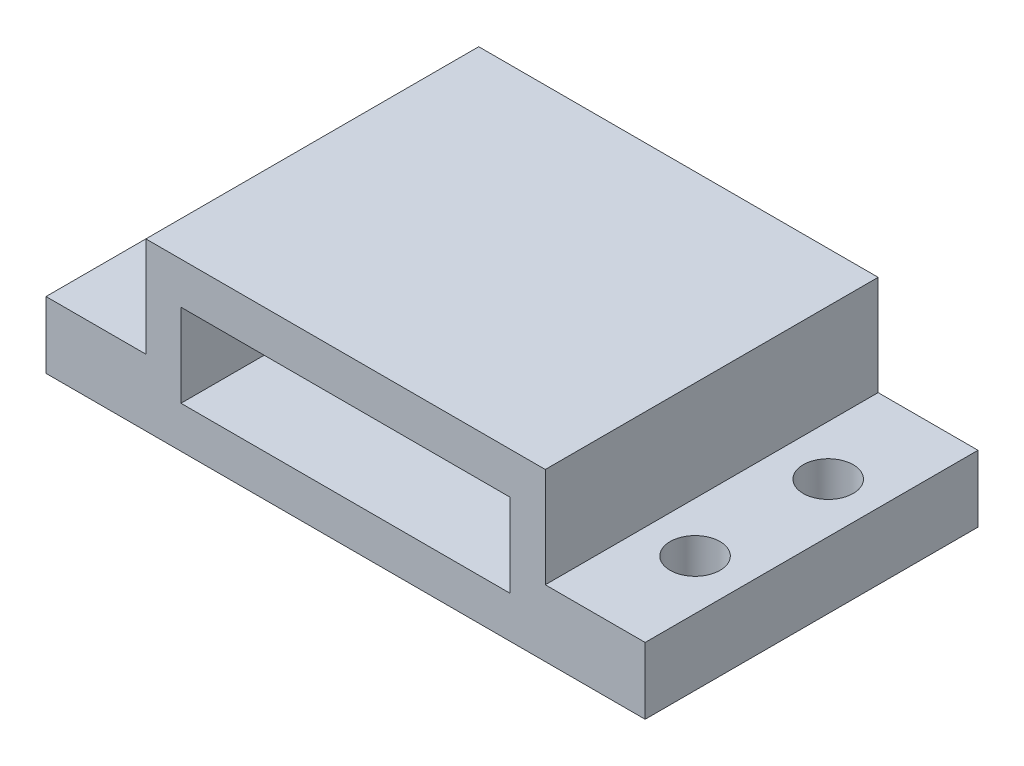
ISO-10303-21;
HEADER;
FILE_DESCRIPTION(('STEP AP214'),'2;1');
FILE_NAME('part.step','',(''),(''),'','','');
FILE_SCHEMA(('AUTOMOTIVE_DESIGN { 1 0 10303 214 1 1 1 1 }'));
ENDSEC;
DATA;
#1=APPLICATION_CONTEXT('core data for automotive mechanical design processes');
#2=APPLICATION_PROTOCOL_DEFINITION('international standard','automotive_design',2000,#1);
#3=PRODUCT_CONTEXT('',#1,'mechanical');
#4=PRODUCT('Part','Part','',(#3));
#5=PRODUCT_RELATED_PRODUCT_CATEGORY('part','',(#4));
#6=PRODUCT_DEFINITION_FORMATION('','',#4);
#7=PRODUCT_DEFINITION_CONTEXT('part definition',#1,'design');
#8=PRODUCT_DEFINITION('design','',#6,#7);
#9=PRODUCT_DEFINITION_SHAPE('','',#8);
#10=(LENGTH_UNIT() NAMED_UNIT(*) SI_UNIT(.MILLI.,.METRE.));
#11=(NAMED_UNIT(*) PLANE_ANGLE_UNIT() SI_UNIT($,.RADIAN.));
#12=(NAMED_UNIT(*) SI_UNIT($,.STERADIAN.) SOLID_ANGLE_UNIT());
#13=UNCERTAINTY_MEASURE_WITH_UNIT(LENGTH_MEASURE(1.E-05),#10,'distance_accuracy_value','');
#14=(GEOMETRIC_REPRESENTATION_CONTEXT(3) GLOBAL_UNCERTAINTY_ASSIGNED_CONTEXT((#13)) GLOBAL_UNIT_ASSIGNED_CONTEXT((#10,
#11,#12)) REPRESENTATION_CONTEXT('',''));
#15=CARTESIAN_POINT('',(0.,0.,0.));
#16=DIRECTION('',(0.,0.,1.));
#17=DIRECTION('',(1.,0.,0.));
#18=AXIS2_PLACEMENT_3D('',#15,#16,#17);
#19=CARTESIAN_POINT('',(6.,5.,0.));
#20=DIRECTION('',(-1.,0.,0.));
#21=DIRECTION('',(0.,0.,1.));
#22=AXIS2_PLACEMENT_3D('',#19,#20,#21);
#23=PLANE('',#22);
#24=DIRECTION('',(0.,0.,1.));
#25=VECTOR('',#24,1.);
#26=CARTESIAN_POINT('',(6.,2.,0.));
#27=LINE('',#26,#25);
#28=CARTESIAN_POINT('',(6.,2.,-10.));
#29=VERTEX_POINT('',#28);
#30=CARTESIAN_POINT('',(6.,2.,0.));
#31=VERTEX_POINT('',#30);
#32=EDGE_CURVE('E61',#29,#31,#27,.T.);
#33=ORIENTED_EDGE('',*,*,#32,.F.);
#34=DIRECTION('',(0.,-1.,0.));
#35=VECTOR('',#34,1.);
#36=CARTESIAN_POINT('',(6.,5.,-10.));
#37=LINE('',#36,#35);
#38=CARTESIAN_POINT('',(6.,5.,-10.));
#39=VERTEX_POINT('',#38);
#40=EDGE_CURVE('E318',#39,#29,#37,.T.);
#41=ORIENTED_EDGE('',*,*,#40,.F.);
#42=DIRECTION('',(0.,0.,-1.));
#43=VECTOR('',#42,1.);
#44=CARTESIAN_POINT('',(6.,5.,0.));
#45=LINE('',#44,#43);
#46=CARTESIAN_POINT('',(6.,5.,0.));
#47=VERTEX_POINT('',#46);
#48=EDGE_CURVE('E307',#47,#39,#45,.T.);
#49=ORIENTED_EDGE('',*,*,#48,.F.);
#50=DIRECTION('',(0.,-1.,0.));
#51=VECTOR('',#50,1.);
#52=CARTESIAN_POINT('',(6.,5.,0.));
#53=LINE('',#52,#51);
#54=EDGE_CURVE('E321',#47,#31,#53,.T.);
#55=ORIENTED_EDGE('',*,*,#54,.T.);
#56=EDGE_LOOP('',(#33,#41,#49,#55));
#57=FACE_BOUND('',#56,.T.);
#58=ADVANCED_FACE('F45',(#57),#23,.F.);
#59=CARTESIAN_POINT('',(0.,5.,-10.));
#60=DIRECTION('',(0.,0.,1.));
#61=DIRECTION('',(1.,0.,0.));
#62=AXIS2_PLACEMENT_3D('',#59,#60,#61);
#63=PLANE('',#62);
#64=DIRECTION('',(-1.,0.,0.));
#65=VECTOR('',#64,1.);
#66=CARTESIAN_POINT('',(0.,0.,-10.));
#67=LINE('',#66,#65);
#68=CARTESIAN_POINT('',(9.,0.,-9.99999999999999));
#69=VERTEX_POINT('',#68);
#70=CARTESIAN_POINT('',(-9.,0.,-10.));
#71=VERTEX_POINT('',#70);
#72=EDGE_CURVE('E160',#69,#71,#67,.T.);
#73=ORIENTED_EDGE('',*,*,#72,.T.);
#74=DIRECTION('',(0.,-1.,0.));
#75=VECTOR('',#74,1.);
#76=CARTESIAN_POINT('',(-9.,0.,-10.));
#77=LINE('',#76,#75);
#78=CARTESIAN_POINT('',(-9.,1.99999368424387,-10.));
#79=VERTEX_POINT('',#78);
#80=EDGE_CURVE('E215',#79,#71,#77,.T.);
#81=ORIENTED_EDGE('',*,*,#80,.F.);
#82=DIRECTION('',(1.,0.,0.));
#83=VECTOR('',#82,1.);
#84=CARTESIAN_POINT('',(-9.,1.99999368424387,-10.));
#85=LINE('',#84,#83);
#86=CARTESIAN_POINT('',(-6.,1.99999368424387,-10.));
#87=VERTEX_POINT('',#86);
#88=EDGE_CURVE('E218',#79,#87,#85,.T.);
#89=ORIENTED_EDGE('',*,*,#88,.T.);
#90=DIRECTION('',(0.,-1.,0.));
#91=VECTOR('',#90,1.);
#92=CARTESIAN_POINT('',(-6.,5.,-10.));
#93=LINE('',#92,#91);
#94=CARTESIAN_POINT('',(-6.,5.,-10.));
#95=VERTEX_POINT('',#94);
#96=EDGE_CURVE('E313',#95,#87,#93,.T.);
#97=ORIENTED_EDGE('',*,*,#96,.F.);
#98=DIRECTION('',(-1.,0.,0.));
#99=VECTOR('',#98,1.);
#100=CARTESIAN_POINT('',(0.,5.,-10.));
#101=LINE('',#100,#99);
#102=EDGE_CURVE('E310',#39,#95,#101,.T.);
#103=ORIENTED_EDGE('',*,*,#102,.F.);
#104=ORIENTED_EDGE('',*,*,#40,.T.);
#105=DIRECTION('',(-1.,0.,0.));
#106=VECTOR('',#105,1.);
#107=CARTESIAN_POINT('',(9.,2.,-10.));
#108=LINE('',#107,#106);
#109=CARTESIAN_POINT('',(9.,2.,-10.));
#110=VERTEX_POINT('',#109);
#111=EDGE_CURVE('E179',#110,#29,#108,.T.);
#112=ORIENTED_EDGE('',*,*,#111,.F.);
#113=DIRECTION('',(0.,1.,0.));
#114=VECTOR('',#113,1.);
#115=CARTESIAN_POINT('',(9.,2.,-10.));
#116=LINE('',#115,#114);
#117=EDGE_CURVE('E175',#69,#110,#116,.T.);
#118=ORIENTED_EDGE('',*,*,#117,.F.);
#119=EDGE_LOOP('',(#73,#81,#89,#97,#103,#104,#112,#118));
#120=FACE_BOUND('',#119,.T.);
#121=DIRECTION('',(0.,1.,0.));
#122=VECTOR('',#121,1.);
#123=CARTESIAN_POINT('',(3.25,0.,-10.));
#124=LINE('',#123,#122);
#125=CARTESIAN_POINT('',(3.25,2.25,-10.));
#126=VERTEX_POINT('',#125);
#127=CARTESIAN_POINT('',(3.25,2.75,-10.));
#128=VERTEX_POINT('',#127);
#129=EDGE_CURVE('E228',#126,#128,#124,.T.);
#130=ORIENTED_EDGE('',*,*,#129,.T.);
#131=DIRECTION('',(1.,0.,0.));
#132=VECTOR('',#131,1.);
#133=CARTESIAN_POINT('',(0.,2.75,-10.));
#134=LINE('',#133,#132);
#135=CARTESIAN_POINT('',(-3.25,2.75,-10.));
#136=VERTEX_POINT('',#135);
#137=EDGE_CURVE('E240',#136,#128,#134,.T.);
#138=ORIENTED_EDGE('',*,*,#137,.F.);
#139=DIRECTION('',(0.,1.,0.));
#140=VECTOR('',#139,1.);
#141=CARTESIAN_POINT('',(-3.25,0.,-10.));
#142=LINE('',#141,#140);
#143=CARTESIAN_POINT('',(-3.25,2.25,-10.));
#144=VERTEX_POINT('',#143);
#145=EDGE_CURVE('E236',#144,#136,#142,.T.);
#146=ORIENTED_EDGE('',*,*,#145,.F.);
#147=DIRECTION('',(-1.,0.,0.));
#148=VECTOR('',#147,1.);
#149=CARTESIAN_POINT('',(0.,2.25,-10.));
#150=LINE('',#149,#148);
#151=EDGE_CURVE('E232',#126,#144,#150,.T.);
#152=ORIENTED_EDGE('',*,*,#151,.F.);
#153=EDGE_LOOP('',(#130,#138,#146,#152));
#154=FACE_BOUND('',#153,.T.);
#155=ADVANCED_FACE('F176',(#120,#154),#63,.F.);
#156=CARTESIAN_POINT('',(0.,0.,-8.));
#157=DIRECTION('',(0.,0.,1.));
#158=DIRECTION('',(1.,0.,0.));
#159=AXIS2_PLACEMENT_3D('',#156,#157,#158);
#160=PLANE('',#159);
#161=DIRECTION('',(0.,1.,0.));
#162=VECTOR('',#161,1.);
#163=CARTESIAN_POINT('',(-4.945,0.,-8.));
#164=LINE('',#163,#162);
#165=CARTESIAN_POINT('',(-4.945,1.25,-8.));
#166=VERTEX_POINT('',#165);
#167=CARTESIAN_POINT('',(-4.945,3.75,-8.));
#168=VERTEX_POINT('',#167);
#169=EDGE_CURVE('E258',#166,#168,#164,.T.);
#170=ORIENTED_EDGE('',*,*,#169,.F.);
#171=DIRECTION('',(1.,0.,0.));
#172=VECTOR('',#171,1.);
#173=CARTESIAN_POINT('',(0.,1.25,-8.));
#174=LINE('',#173,#172);
#175=CARTESIAN_POINT('',(4.945,1.25,-8.));
#176=VERTEX_POINT('',#175);
#177=EDGE_CURVE('E261',#166,#176,#174,.T.);
#178=ORIENTED_EDGE('',*,*,#177,.T.);
#179=DIRECTION('',(0.,1.,0.));
#180=VECTOR('',#179,1.);
#181=CARTESIAN_POINT('',(4.945,0.,-8.));
#182=LINE('',#181,#180);
#183=CARTESIAN_POINT('',(4.945,3.75,-8.));
#184=VERTEX_POINT('',#183);
#185=EDGE_CURVE('E266',#176,#184,#182,.T.);
#186=ORIENTED_EDGE('',*,*,#185,.T.);
#187=DIRECTION('',(-1.,0.,0.));
#188=VECTOR('',#187,1.);
#189=CARTESIAN_POINT('',(0.,3.75,-8.));
#190=LINE('',#189,#188);
#191=EDGE_CURVE('E270',#184,#168,#190,.T.);
#192=ORIENTED_EDGE('',*,*,#191,.T.);
#193=EDGE_LOOP('',(#170,#178,#186,#192));
#194=FACE_BOUND('',#193,.T.);
#195=DIRECTION('',(-1.,0.,0.));
#196=VECTOR('',#195,1.);
#197=CARTESIAN_POINT('',(0.,2.75,-8.));
#198=LINE('',#197,#196);
#199=CARTESIAN_POINT('',(3.25,2.75,-8.));
#200=VERTEX_POINT('',#199);
#201=CARTESIAN_POINT('',(-3.25,2.75,-8.));
#202=VERTEX_POINT('',#201);
#203=EDGE_CURVE('E54',#200,#202,#198,.T.);
#204=ORIENTED_EDGE('',*,*,#203,.F.);
#205=DIRECTION('',(0.,-1.,0.));
#206=VECTOR('',#205,1.);
#207=CARTESIAN_POINT('',(3.25,0.,-8.));
#208=LINE('',#207,#206);
#209=CARTESIAN_POINT('',(3.25,2.25,-8.));
#210=VERTEX_POINT('',#209);
#211=EDGE_CURVE('E11',#200,#210,#208,.T.);
#212=ORIENTED_EDGE('',*,*,#211,.T.);
#213=DIRECTION('',(1.,0.,0.));
#214=VECTOR('',#213,1.);
#215=CARTESIAN_POINT('',(0.,2.25,-8.));
#216=LINE('',#215,#214);
#217=CARTESIAN_POINT('',(-3.25,2.25,-8.));
#218=VERTEX_POINT('',#217);
#219=EDGE_CURVE('E327',#218,#210,#216,.T.);
#220=ORIENTED_EDGE('',*,*,#219,.F.);
#221=DIRECTION('',(0.,-1.,0.));
#222=VECTOR('',#221,1.);
#223=CARTESIAN_POINT('',(-3.25,0.,-8.));
#224=LINE('',#223,#222);
#225=EDGE_CURVE('E330',#202,#218,#224,.T.);
#226=ORIENTED_EDGE('',*,*,#225,.F.);
#227=EDGE_LOOP('',(#204,#212,#220,#226));
#228=FACE_BOUND('',#227,.T.);
#229=ADVANCED_FACE('F346',(#194,#228),#160,.T.);
#230=CARTESIAN_POINT('',(0.,5.,0.));
#231=DIRECTION('',(0.,0.,-1.));
#232=DIRECTION('',(-1.,0.,0.));
#233=AXIS2_PLACEMENT_3D('',#230,#231,#232);
#234=PLANE('',#233);
#235=DIRECTION('',(1.,0.,0.));
#236=VECTOR('',#235,1.);
#237=CARTESIAN_POINT('',(0.,0.,0.));
#238=LINE('',#237,#236);
#239=CARTESIAN_POINT('',(-9.,0.,0.));
#240=VERTEX_POINT('',#239);
#241=CARTESIAN_POINT('',(9.,0.,0.));
#242=VERTEX_POINT('',#241);
#243=EDGE_CURVE('E172',#240,#242,#238,.T.);
#244=ORIENTED_EDGE('',*,*,#243,.T.);
#245=DIRECTION('',(0.,-1.,0.));
#246=VECTOR('',#245,1.);
#247=CARTESIAN_POINT('',(9.,0.,0.));
#248=LINE('',#247,#246);
#249=CARTESIAN_POINT('',(9.,2.,0.));
#250=VERTEX_POINT('',#249);
#251=EDGE_CURVE('E188',#250,#242,#248,.T.);
#252=ORIENTED_EDGE('',*,*,#251,.F.);
#253=DIRECTION('',(-1.,0.,0.));
#254=VECTOR('',#253,1.);
#255=CARTESIAN_POINT('',(9.,2.,0.));
#256=LINE('',#255,#254);
#257=EDGE_CURVE('E200',#250,#31,#256,.T.);
#258=ORIENTED_EDGE('',*,*,#257,.T.);
#259=ORIENTED_EDGE('',*,*,#54,.F.);
#260=DIRECTION('',(1.,0.,0.));
#261=VECTOR('',#260,1.);
#262=CARTESIAN_POINT('',(0.,5.,0.));
#263=LINE('',#262,#261);
#264=CARTESIAN_POINT('',(-6.,5.,0.));
#265=VERTEX_POINT('',#264);
#266=EDGE_CURVE('E304',#265,#47,#263,.T.);
#267=ORIENTED_EDGE('',*,*,#266,.F.);
#268=DIRECTION('',(0.,-1.,0.));
#269=VECTOR('',#268,1.);
#270=CARTESIAN_POINT('',(-6.,5.,0.));
#271=LINE('',#270,#269);
#272=CARTESIAN_POINT('',(-6.,1.99999368424387,0.));
#273=VERTEX_POINT('',#272);
#274=EDGE_CURVE('E324',#265,#273,#271,.T.);
#275=ORIENTED_EDGE('',*,*,#274,.T.);
#276=DIRECTION('',(1.,0.,0.));
#277=VECTOR('',#276,1.);
#278=CARTESIAN_POINT('',(-9.,1.99999368424387,0.));
#279=LINE('',#278,#277);
#280=CARTESIAN_POINT('',(-9.,1.99999368424387,0.));
#281=VERTEX_POINT('',#280);
#282=EDGE_CURVE('E224',#281,#273,#279,.T.);
#283=ORIENTED_EDGE('',*,*,#282,.F.);
#284=DIRECTION('',(0.,1.,0.));
#285=VECTOR('',#284,1.);
#286=CARTESIAN_POINT('',(-9.,1.99999368424387,0.));
#287=LINE('',#286,#285);
#288=EDGE_CURVE('E209',#240,#281,#287,.T.);
#289=ORIENTED_EDGE('',*,*,#288,.F.);
#290=EDGE_LOOP('',(#244,#252,#258,#259,#267,#275,#283,#289));
#291=FACE_BOUND('',#290,.T.);
#292=DIRECTION('',(0.,1.,0.));
#293=VECTOR('',#292,1.);
#294=CARTESIAN_POINT('',(-4.945,0.,0.));
#295=LINE('',#294,#293);
#296=CARTESIAN_POINT('',(-4.945,1.25,0.));
#297=VERTEX_POINT('',#296);
#298=CARTESIAN_POINT('',(-4.945,3.75,0.));
#299=VERTEX_POINT('',#298);
#300=EDGE_CURVE('E248',#297,#299,#295,.T.);
#301=ORIENTED_EDGE('',*,*,#300,.T.);
#302=DIRECTION('',(-1.,0.,0.));
#303=VECTOR('',#302,1.);
#304=CARTESIAN_POINT('',(0.,3.75,0.));
#305=LINE('',#304,#303);
#306=CARTESIAN_POINT('',(4.945,3.75,0.));
#307=VERTEX_POINT('',#306);
#308=EDGE_CURVE('E262',#307,#299,#305,.T.);
#309=ORIENTED_EDGE('',*,*,#308,.F.);
#310=DIRECTION('',(0.,1.,0.));
#311=VECTOR('',#310,1.);
#312=CARTESIAN_POINT('',(4.945,0.,0.));
#313=LINE('',#312,#311);
#314=CARTESIAN_POINT('',(4.945,1.25,0.));
#315=VERTEX_POINT('',#314);
#316=EDGE_CURVE('E282',#315,#307,#313,.T.);
#317=ORIENTED_EDGE('',*,*,#316,.F.);
#318=DIRECTION('',(1.,0.,0.));
#319=VECTOR('',#318,1.);
#320=CARTESIAN_POINT('',(0.,1.25,0.));
#321=LINE('',#320,#319);
#322=EDGE_CURVE('E278',#297,#315,#321,.T.);
#323=ORIENTED_EDGE('',*,*,#322,.F.);
#324=EDGE_LOOP('',(#301,#309,#317,#323));
#325=FACE_BOUND('',#324,.T.);
#326=ADVANCED_FACE('F359',(#291,#325),#234,.F.);
#327=CARTESIAN_POINT('',(-6.,5.,0.));
#328=DIRECTION('',(-1.,0.,0.));
#329=DIRECTION('',(0.,0.,1.));
#330=AXIS2_PLACEMENT_3D('',#327,#328,#329);
#331=PLANE('',#330);
#332=DIRECTION('',(0.,0.,-1.));
#333=VECTOR('',#332,1.);
#334=CARTESIAN_POINT('',(-6.,1.99999368424387,-10.));
#335=LINE('',#334,#333);
#336=EDGE_CURVE('E69',#273,#87,#335,.T.);
#337=ORIENTED_EDGE('',*,*,#336,.F.);
#338=ORIENTED_EDGE('',*,*,#274,.F.);
#339=DIRECTION('',(0.,0.,-1.));
#340=VECTOR('',#339,1.);
#341=CARTESIAN_POINT('',(-6.,5.,0.));
#342=LINE('',#341,#340);
#343=EDGE_CURVE('E171',#265,#95,#342,.T.);
#344=ORIENTED_EDGE('',*,*,#343,.T.);
#345=ORIENTED_EDGE('',*,*,#96,.T.);
#346=EDGE_LOOP('',(#337,#338,#344,#345));
#347=FACE_BOUND('',#346,.T.);
#348=ADVANCED_FACE('F47',(#347),#331,.T.);
#349=CARTESIAN_POINT('',(0.,5.,0.));
#350=DIRECTION('',(0.,1.,0.));
#351=DIRECTION('',(0.,0.,1.));
#352=AXIS2_PLACEMENT_3D('',#349,#350,#351);
#353=PLANE('',#352);
#354=ORIENTED_EDGE('',*,*,#343,.F.);
#355=ORIENTED_EDGE('',*,*,#266,.T.);
#356=ORIENTED_EDGE('',*,*,#48,.T.);
#357=ORIENTED_EDGE('',*,*,#102,.T.);
#358=EDGE_LOOP('',(#354,#355,#356,#357));
#359=FACE_BOUND('',#358,.T.);
#360=ADVANCED_FACE('F370',(#359),#353,.T.);
#361=CARTESIAN_POINT('',(0.,0.,0.));
#362=DIRECTION('',(0.,1.,0.));
#363=DIRECTION('',(0.,0.,1.));
#364=AXIS2_PLACEMENT_3D('',#361,#362,#363);
#365=PLANE('',#364);
#366=CARTESIAN_POINT('',(7.5,0.,-7.));
#367=DIRECTION('',(0.,1.,0.));
#368=DIRECTION('',(0.,0.,1.));
#369=AXIS2_PLACEMENT_3D('',#366,#367,#368);
#370=CIRCLE('',#369,0.749999999999999);
#371=CARTESIAN_POINT('',(7.5,0.,-6.25));
#372=VERTEX_POINT('',#371);
#373=EDGE_CURVE('E668',#372,#372,#370,.T.);
#374=ORIENTED_EDGE('',*,*,#373,.T.);
#375=EDGE_LOOP('',(#374));
#376=FACE_BOUND('',#375,.T.);
#377=CARTESIAN_POINT('',(7.5,0.,-3.));
#378=DIRECTION('',(0.,1.,0.));
#379=DIRECTION('',(0.,0.,1.));
#380=AXIS2_PLACEMENT_3D('',#377,#378,#379);
#381=CIRCLE('',#380,0.749999999999992);
#382=CARTESIAN_POINT('',(7.5,0.,-2.25000000000001));
#383=VERTEX_POINT('',#382);
#384=EDGE_CURVE('E673',#383,#383,#381,.T.);
#385=ORIENTED_EDGE('',*,*,#384,.T.);
#386=EDGE_LOOP('',(#385));
#387=FACE_BOUND('',#386,.T.);
#388=CARTESIAN_POINT('',(-7.5,0.,-3.));
#389=DIRECTION('',(0.,1.,0.));
#390=DIRECTION('',(0.,0.,1.));
#391=AXIS2_PLACEMENT_3D('',#388,#389,#390);
#392=CIRCLE('',#391,0.749999999999998);
#393=CARTESIAN_POINT('',(-7.5,0.,-2.25));
#394=VERTEX_POINT('',#393);
#395=EDGE_CURVE('E192',#394,#394,#392,.T.);
#396=ORIENTED_EDGE('',*,*,#395,.T.);
#397=EDGE_LOOP('',(#396));
#398=FACE_BOUND('',#397,.T.);
#399=CARTESIAN_POINT('',(-7.5,0.,-7.));
#400=DIRECTION('',(0.,1.,0.));
#401=DIRECTION('',(0.,0.,1.));
#402=AXIS2_PLACEMENT_3D('',#399,#400,#401);
#403=CIRCLE('',#402,0.749999999999999);
#404=CARTESIAN_POINT('',(-7.5,0.,-6.25));
#405=VERTEX_POINT('',#404);
#406=EDGE_CURVE('E665',#405,#405,#403,.T.);
#407=ORIENTED_EDGE('',*,*,#406,.T.);
#408=EDGE_LOOP('',(#407));
#409=FACE_BOUND('',#408,.T.);
#410=ORIENTED_EDGE('',*,*,#243,.F.);
#411=DIRECTION('',(0.,0.,1.));
#412=VECTOR('',#411,1.);
#413=CARTESIAN_POINT('',(-9.,0.,-10.));
#414=LINE('',#413,#412);
#415=EDGE_CURVE('E166',#71,#240,#414,.T.);
#416=ORIENTED_EDGE('',*,*,#415,.F.);
#417=ORIENTED_EDGE('',*,*,#72,.F.);
#418=DIRECTION('',(0.,0.,-1.));
#419=VECTOR('',#418,1.);
#420=CARTESIAN_POINT('',(9.,0.,-9.99999999999999));
#421=LINE('',#420,#419);
#422=EDGE_CURVE('E164',#242,#69,#421,.T.);
#423=ORIENTED_EDGE('',*,*,#422,.F.);
#424=EDGE_LOOP('',(#410,#416,#417,#423));
#425=FACE_BOUND('',#424,.T.);
#426=ADVANCED_FACE('F162',(#376,#387,#398,#409,#425),#365,.F.);
#427=CARTESIAN_POINT('',(-4.945,0.,-8.));
#428=DIRECTION('',(1.,0.,0.));
#429=DIRECTION('',(0.,0.,-1.));
#430=AXIS2_PLACEMENT_3D('',#427,#428,#429);
#431=PLANE('',#430);
#432=ORIENTED_EDGE('',*,*,#300,.F.);
#433=DIRECTION('',(0.,0.,1.));
#434=VECTOR('',#433,1.);
#435=CARTESIAN_POINT('',(-4.945,1.25,-8.));
#436=LINE('',#435,#434);
#437=EDGE_CURVE('E274',#166,#297,#436,.T.);
#438=ORIENTED_EDGE('',*,*,#437,.F.);
#439=ORIENTED_EDGE('',*,*,#169,.T.);
#440=DIRECTION('',(0.,0.,1.));
#441=VECTOR('',#440,1.);
#442=CARTESIAN_POINT('',(-4.945,3.75,-8.));
#443=LINE('',#442,#441);
#444=EDGE_CURVE('E289',#168,#299,#443,.T.);
#445=ORIENTED_EDGE('',*,*,#444,.T.);
#446=EDGE_LOOP('',(#432,#438,#439,#445));
#447=FACE_BOUND('',#446,.T.);
#448=ADVANCED_FACE('F377',(#447),#431,.T.);
#449=CARTESIAN_POINT('',(0.,3.75,-8.));
#450=DIRECTION('',(0.,1.,0.));
#451=DIRECTION('',(0.,0.,1.));
#452=AXIS2_PLACEMENT_3D('',#449,#450,#451);
#453=PLANE('',#452);
#454=ORIENTED_EDGE('',*,*,#308,.T.);
#455=ORIENTED_EDGE('',*,*,#444,.F.);
#456=ORIENTED_EDGE('',*,*,#191,.F.);
#457=DIRECTION('',(0.,0.,1.));
#458=VECTOR('',#457,1.);
#459=CARTESIAN_POINT('',(4.945,3.75,-8.));
#460=LINE('',#459,#458);
#461=EDGE_CURVE('E292',#184,#307,#460,.T.);
#462=ORIENTED_EDGE('',*,*,#461,.T.);
#463=EDGE_LOOP('',(#454,#455,#456,#462));
#464=FACE_BOUND('',#463,.T.);
#465=ADVANCED_FACE('F386',(#464),#453,.F.);
#466=CARTESIAN_POINT('',(4.945,0.,-8.));
#467=DIRECTION('',(1.,0.,0.));
#468=DIRECTION('',(0.,0.,-1.));
#469=AXIS2_PLACEMENT_3D('',#466,#467,#468);
#470=PLANE('',#469);
#471=ORIENTED_EDGE('',*,*,#316,.T.);
#472=ORIENTED_EDGE('',*,*,#461,.F.);
#473=ORIENTED_EDGE('',*,*,#185,.F.);
#474=DIRECTION('',(0.,0.,1.));
#475=VECTOR('',#474,1.);
#476=CARTESIAN_POINT('',(4.945,1.25,-8.));
#477=LINE('',#476,#475);
#478=EDGE_CURVE('E295',#176,#315,#477,.T.);
#479=ORIENTED_EDGE('',*,*,#478,.T.);
#480=EDGE_LOOP('',(#471,#472,#473,#479));
#481=FACE_BOUND('',#480,.T.);
#482=ADVANCED_FACE('F388',(#481),#470,.F.);
#483=CARTESIAN_POINT('',(0.,1.25,-8.));
#484=DIRECTION('',(0.,-1.,0.));
#485=DIRECTION('',(0.,0.,-1.));
#486=AXIS2_PLACEMENT_3D('',#483,#484,#485);
#487=PLANE('',#486);
#488=ORIENTED_EDGE('',*,*,#322,.T.);
#489=ORIENTED_EDGE('',*,*,#478,.F.);
#490=ORIENTED_EDGE('',*,*,#177,.F.);
#491=ORIENTED_EDGE('',*,*,#437,.T.);
#492=EDGE_LOOP('',(#488,#489,#490,#491));
#493=FACE_BOUND('',#492,.T.);
#494=ADVANCED_FACE('F382',(#493),#487,.F.);
#495=CARTESIAN_POINT('',(3.25,0.,-2.));
#496=DIRECTION('',(-1.,0.,0.));
#497=DIRECTION('',(0.,0.,1.));
#498=AXIS2_PLACEMENT_3D('',#495,#496,#497);
#499=PLANE('',#498);
#500=DIRECTION('',(0.,0.,-1.));
#501=VECTOR('',#500,1.);
#502=CARTESIAN_POINT('',(3.25,2.75,-2.));
#503=LINE('',#502,#501);
#504=EDGE_CURVE('E245',#200,#128,#503,.T.);
#505=ORIENTED_EDGE('',*,*,#504,.T.);
#506=ORIENTED_EDGE('',*,*,#129,.F.);
#507=DIRECTION('',(0.,0.,-1.));
#508=VECTOR('',#507,1.);
#509=CARTESIAN_POINT('',(3.25,2.25,-2.));
#510=LINE('',#509,#508);
#511=EDGE_CURVE('E244',#210,#126,#510,.T.);
#512=ORIENTED_EDGE('',*,*,#511,.F.);
#513=ORIENTED_EDGE('',*,*,#211,.F.);
#514=EDGE_LOOP('',(#505,#506,#512,#513));
#515=FACE_BOUND('',#514,.T.);
#516=ADVANCED_FACE('F352',(#515),#499,.T.);
#517=CARTESIAN_POINT('',(0.,2.75,-2.));
#518=DIRECTION('',(0.,1.,0.));
#519=DIRECTION('',(0.,0.,1.));
#520=AXIS2_PLACEMENT_3D('',#517,#518,#519);
#521=PLANE('',#520);
#522=ORIENTED_EDGE('',*,*,#203,.T.);
#523=DIRECTION('',(0.,0.,-1.));
#524=VECTOR('',#523,1.);
#525=CARTESIAN_POINT('',(-3.25,2.75,-2.));
#526=LINE('',#525,#524);
#527=EDGE_CURVE('E249',#202,#136,#526,.T.);
#528=ORIENTED_EDGE('',*,*,#527,.T.);
#529=ORIENTED_EDGE('',*,*,#137,.T.);
#530=ORIENTED_EDGE('',*,*,#504,.F.);
#531=EDGE_LOOP('',(#522,#528,#529,#530));
#532=FACE_BOUND('',#531,.T.);
#533=ADVANCED_FACE('F338',(#532),#521,.F.);
#534=CARTESIAN_POINT('',(-3.25,0.,-2.));
#535=DIRECTION('',(-1.,0.,0.));
#536=DIRECTION('',(0.,0.,1.));
#537=AXIS2_PLACEMENT_3D('',#534,#535,#536);
#538=PLANE('',#537);
#539=ORIENTED_EDGE('',*,*,#225,.T.);
#540=DIRECTION('',(0.,0.,-1.));
#541=VECTOR('',#540,1.);
#542=CARTESIAN_POINT('',(-3.25,2.25,-2.));
#543=LINE('',#542,#541);
#544=EDGE_CURVE('E252',#218,#144,#543,.T.);
#545=ORIENTED_EDGE('',*,*,#544,.T.);
#546=ORIENTED_EDGE('',*,*,#145,.T.);
#547=ORIENTED_EDGE('',*,*,#527,.F.);
#548=EDGE_LOOP('',(#539,#545,#546,#547));
#549=FACE_BOUND('',#548,.T.);
#550=ADVANCED_FACE('F342',(#549),#538,.F.);
#551=CARTESIAN_POINT('',(0.,2.25,-2.));
#552=DIRECTION('',(0.,-1.,0.));
#553=DIRECTION('',(0.,0.,-1.));
#554=AXIS2_PLACEMENT_3D('',#551,#552,#553);
#555=PLANE('',#554);
#556=ORIENTED_EDGE('',*,*,#219,.T.);
#557=ORIENTED_EDGE('',*,*,#511,.T.);
#558=ORIENTED_EDGE('',*,*,#151,.T.);
#559=ORIENTED_EDGE('',*,*,#544,.F.);
#560=EDGE_LOOP('',(#556,#557,#558,#559));
#561=FACE_BOUND('',#560,.T.);
#562=ADVANCED_FACE('F349',(#561),#555,.F.);
#563=CARTESIAN_POINT('',(-9.,1.99999368424387,-10.));
#564=DIRECTION('',(0.,-1.,0.));
#565=DIRECTION('',(0.,0.,-1.));
#566=AXIS2_PLACEMENT_3D('',#563,#564,#565);
#567=PLANE('',#566);
#568=CARTESIAN_POINT('',(-7.5,2.,-3.));
#569=DIRECTION('',(0.,1.,0.));
#570=DIRECTION('',(0.,0.,-1.));
#571=AXIS2_PLACEMENT_3D('',#568,#569,#570);
#572=CIRCLE('',#571,0.749999999999998);
#573=CARTESIAN_POINT('',(-7.5,2.,-3.75));
#574=VERTEX_POINT('',#573);
#575=EDGE_CURVE('E660',#574,#574,#572,.T.);
#576=ORIENTED_EDGE('',*,*,#575,.F.);
#577=EDGE_LOOP('',(#576));
#578=FACE_BOUND('',#577,.T.);
#579=CARTESIAN_POINT('',(-7.5,2.,-7.));
#580=DIRECTION('',(0.,1.,0.));
#581=DIRECTION('',(0.,0.,1.));
#582=AXIS2_PLACEMENT_3D('',#579,#580,#581);
#583=CIRCLE('',#582,0.749999999999999);
#584=CARTESIAN_POINT('',(-7.5,2.,-6.25));
#585=VERTEX_POINT('',#584);
#586=EDGE_CURVE('E679',#585,#585,#583,.T.);
#587=ORIENTED_EDGE('',*,*,#586,.F.);
#588=EDGE_LOOP('',(#587));
#589=FACE_BOUND('',#588,.T.);
#590=ORIENTED_EDGE('',*,*,#336,.T.);
#591=ORIENTED_EDGE('',*,*,#88,.F.);
#592=DIRECTION('',(0.,0.,-1.));
#593=VECTOR('',#592,1.);
#594=CARTESIAN_POINT('',(-9.,1.99999368424387,-10.));
#595=LINE('',#594,#593);
#596=EDGE_CURVE('E212',#281,#79,#595,.T.);
#597=ORIENTED_EDGE('',*,*,#596,.F.);
#598=ORIENTED_EDGE('',*,*,#282,.T.);
#599=EDGE_LOOP('',(#590,#591,#597,#598));
#600=FACE_BOUND('',#599,.T.);
#601=ADVANCED_FACE('F416',(#578,#589,#600),#567,.F.);
#602=CARTESIAN_POINT('',(-9.,0.,0.));
#603=DIRECTION('',(1.,0.,0.));
#604=DIRECTION('',(0.,0.,-1.));
#605=AXIS2_PLACEMENT_3D('',#602,#603,#604);
#606=PLANE('',#605);
#607=ORIENTED_EDGE('',*,*,#415,.T.);
#608=ORIENTED_EDGE('',*,*,#288,.T.);
#609=ORIENTED_EDGE('',*,*,#596,.T.);
#610=ORIENTED_EDGE('',*,*,#80,.T.);
#611=EDGE_LOOP('',(#607,#608,#609,#610));
#612=FACE_BOUND('',#611,.T.);
#613=ADVANCED_FACE('F418',(#612),#606,.F.);
#614=CARTESIAN_POINT('',(9.,2.,0.));
#615=DIRECTION('',(0.,-1.,0.));
#616=DIRECTION('',(0.,0.,-1.));
#617=AXIS2_PLACEMENT_3D('',#614,#615,#616);
#618=PLANE('',#617);
#619=CARTESIAN_POINT('',(7.5,2.,-7.));
#620=DIRECTION('',(0.,1.,0.));
#621=DIRECTION('',(0.,0.,-1.));
#622=AXIS2_PLACEMENT_3D('',#619,#620,#621);
#623=CIRCLE('',#622,0.749999999999999);
#624=CARTESIAN_POINT('',(7.5,2.,-7.75));
#625=VERTEX_POINT('',#624);
#626=EDGE_CURVE('E683',#625,#625,#623,.T.);
#627=ORIENTED_EDGE('',*,*,#626,.F.);
#628=EDGE_LOOP('',(#627));
#629=FACE_BOUND('',#628,.T.);
#630=CARTESIAN_POINT('',(7.5,2.,-3.));
#631=DIRECTION('',(0.,1.,0.));
#632=DIRECTION('',(0.,0.,1.));
#633=AXIS2_PLACEMENT_3D('',#630,#631,#632);
#634=CIRCLE('',#633,0.749999999999992);
#635=CARTESIAN_POINT('',(7.5,2.,-2.25000000000001));
#636=VERTEX_POINT('',#635);
#637=EDGE_CURVE('E687',#636,#636,#634,.T.);
#638=ORIENTED_EDGE('',*,*,#637,.F.);
#639=EDGE_LOOP('',(#638));
#640=FACE_BOUND('',#639,.T.);
#641=ORIENTED_EDGE('',*,*,#32,.T.);
#642=ORIENTED_EDGE('',*,*,#257,.F.);
#643=DIRECTION('',(0.,0.,1.));
#644=VECTOR('',#643,1.);
#645=CARTESIAN_POINT('',(9.,2.,0.));
#646=LINE('',#645,#644);
#647=EDGE_CURVE('E183',#110,#250,#646,.T.);
#648=ORIENTED_EDGE('',*,*,#647,.F.);
#649=ORIENTED_EDGE('',*,*,#111,.T.);
#650=EDGE_LOOP('',(#641,#642,#648,#649));
#651=FACE_BOUND('',#650,.T.);
#652=ADVANCED_FACE('F420',(#629,#640,#651),#618,.F.);
#653=CARTESIAN_POINT('',(9.,0.,0.));
#654=DIRECTION('',(-1.,0.,0.));
#655=DIRECTION('',(0.,0.,1.));
#656=AXIS2_PLACEMENT_3D('',#653,#654,#655);
#657=PLANE('',#656);
#658=ORIENTED_EDGE('',*,*,#422,.T.);
#659=ORIENTED_EDGE('',*,*,#117,.T.);
#660=ORIENTED_EDGE('',*,*,#647,.T.);
#661=ORIENTED_EDGE('',*,*,#251,.T.);
#662=EDGE_LOOP('',(#658,#659,#660,#661));
#663=FACE_BOUND('',#662,.T.);
#664=ADVANCED_FACE('F186',(#663),#657,.F.);
#665=CARTESIAN_POINT('',(7.5,-1.,-3.));
#666=DIRECTION('',(0.,1.,0.));
#667=DIRECTION('',(0.,0.,1.));
#668=AXIS2_PLACEMENT_3D('',#665,#666,#667);
#669=CYLINDRICAL_SURFACE('',#668,0.749999999999992);
#670=ORIENTED_EDGE('',*,*,#637,.T.);
#671=EDGE_LOOP('',(#670));
#672=FACE_BOUND('',#671,.T.);
#673=ORIENTED_EDGE('',*,*,#384,.F.);
#674=EDGE_LOOP('',(#673));
#675=FACE_BOUND('',#674,.T.);
#676=ADVANCED_FACE('F482',(#672,#675),#669,.F.);
#677=CARTESIAN_POINT('',(7.5,-1.,-7.));
#678=DIRECTION('',(0.,1.,0.));
#679=DIRECTION('',(0.,0.,1.));
#680=AXIS2_PLACEMENT_3D('',#677,#678,#679);
#681=CYLINDRICAL_SURFACE('',#680,0.749999999999999);
#682=ORIENTED_EDGE('',*,*,#626,.T.);
#683=EDGE_LOOP('',(#682));
#684=FACE_BOUND('',#683,.T.);
#685=ORIENTED_EDGE('',*,*,#373,.F.);
#686=EDGE_LOOP('',(#685));
#687=FACE_BOUND('',#686,.T.);
#688=ADVANCED_FACE('F487',(#684,#687),#681,.F.);
#689=CARTESIAN_POINT('',(-7.5,-1.,-7.));
#690=DIRECTION('',(0.,1.,0.));
#691=DIRECTION('',(0.,0.,1.));
#692=AXIS2_PLACEMENT_3D('',#689,#690,#691);
#693=CYLINDRICAL_SURFACE('',#692,0.749999999999999);
#694=ORIENTED_EDGE('',*,*,#586,.T.);
#695=EDGE_LOOP('',(#694));
#696=FACE_BOUND('',#695,.T.);
#697=ORIENTED_EDGE('',*,*,#406,.F.);
#698=EDGE_LOOP('',(#697));
#699=FACE_BOUND('',#698,.T.);
#700=ADVANCED_FACE('F498',(#696,#699),#693,.F.);
#701=CARTESIAN_POINT('',(-7.5,-1.,-3.));
#702=DIRECTION('',(0.,1.,0.));
#703=DIRECTION('',(0.,0.,1.));
#704=AXIS2_PLACEMENT_3D('',#701,#702,#703);
#705=CYLINDRICAL_SURFACE('',#704,0.749999999999998);
#706=ORIENTED_EDGE('',*,*,#575,.T.);
#707=EDGE_LOOP('',(#706));
#708=FACE_BOUND('',#707,.T.);
#709=ORIENTED_EDGE('',*,*,#395,.F.);
#710=EDGE_LOOP('',(#709));
#711=FACE_BOUND('',#710,.T.);
#712=ADVANCED_FACE('F509',(#708,#711),#705,.F.);
#713=CLOSED_SHELL('',(#58,#155,#229,#326,#348,#360,#426,#448,#465,#482,#494,#516,#533,#550,#562,
#601,#613,#652,#664,#676,#688,#700,#712));
#714=MANIFOLD_SOLID_BREP('B2',#713);
#715=ADVANCED_BREP_SHAPE_REPRESENTATION('',(#18,#714),#14);
#716=SHAPE_DEFINITION_REPRESENTATION(#9,#715);
ENDSEC;
END-ISO-10303-21;
